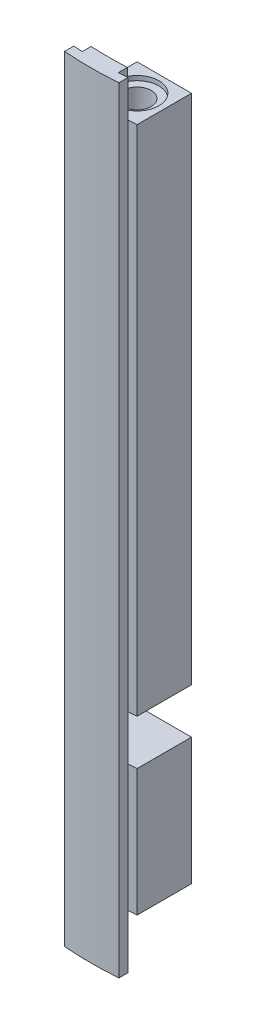
ISO-10303-21;
HEADER;
FILE_DESCRIPTION(('STEP AP214'),'2;1');
FILE_NAME('part.step','',(''),(''),'','','');
FILE_SCHEMA(('AUTOMOTIVE_DESIGN { 1 0 10303 214 1 1 1 1 }'));
ENDSEC;
DATA;
#1=APPLICATION_CONTEXT('core data for automotive mechanical design processes');
#2=APPLICATION_PROTOCOL_DEFINITION('international standard','automotive_design',2000,#1);
#3=PRODUCT_CONTEXT('',#1,'mechanical');
#4=PRODUCT('Part','Part','',(#3));
#5=PRODUCT_RELATED_PRODUCT_CATEGORY('part','',(#4));
#6=PRODUCT_DEFINITION_FORMATION('','',#4);
#7=PRODUCT_DEFINITION_CONTEXT('part definition',#1,'design');
#8=PRODUCT_DEFINITION('design','',#6,#7);
#9=PRODUCT_DEFINITION_SHAPE('','',#8);
#10=(LENGTH_UNIT() NAMED_UNIT(*) SI_UNIT(.MILLI.,.METRE.));
#11=(NAMED_UNIT(*) PLANE_ANGLE_UNIT() SI_UNIT($,.RADIAN.));
#12=(NAMED_UNIT(*) SI_UNIT($,.STERADIAN.) SOLID_ANGLE_UNIT());
#13=UNCERTAINTY_MEASURE_WITH_UNIT(LENGTH_MEASURE(1.E-05),#10,'distance_accuracy_value','');
#14=(GEOMETRIC_REPRESENTATION_CONTEXT(3) GLOBAL_UNCERTAINTY_ASSIGNED_CONTEXT((#13)) GLOBAL_UNIT_ASSIGNED_CONTEXT((#10,
#11,#12)) REPRESENTATION_CONTEXT('',''));
#15=CARTESIAN_POINT('',(0.,0.,0.));
#16=DIRECTION('',(0.,0.,1.));
#17=DIRECTION('',(1.,0.,0.));
#18=AXIS2_PLACEMENT_3D('',#15,#16,#17);
#19=CARTESIAN_POINT('',(-5.27213682165313E-13,-80.5,0.));
#20=DIRECTION('',(0.,1.,0.));
#21=DIRECTION('',(-1.,0.,0.));
#22=AXIS2_PLACEMENT_3D('',#19,#20,#21);
#23=CYLINDRICAL_SURFACE('',#22,37.5);
#24=DIRECTION('',(0.,1.,0.));
#25=VECTOR('',#24,1.);
#26=CARTESIAN_POINT('',(-2.00000115997713,-85.5,37.4466286247519));
#27=LINE('',#26,#25);
#28=CARTESIAN_POINT('',(-2.00000115997714,-80.5,37.446628624752));
#29=VERTEX_POINT('',#28);
#30=CARTESIAN_POINT('',(-2.00000115997713,-66.5,37.4466286247519));
#31=VERTEX_POINT('',#30);
#32=EDGE_CURVE('E314',#29,#31,#27,.T.);
#33=ORIENTED_EDGE('',*,*,#32,.T.);
#34=CARTESIAN_POINT('',(0.,-66.5,0.));
#35=DIRECTION('',(0.,1.,0.));
#36=DIRECTION('',(0.,0.,1.));
#37=AXIS2_PLACEMENT_3D('',#34,#35,#36);
#38=CIRCLE('',#37,37.5);
#39=CARTESIAN_POINT('',(-3.00000000000015,-66.5,37.3798073831313));
#40=VERTEX_POINT('',#39);
#41=EDGE_CURVE('E234',#40,#31,#38,.T.);
#42=ORIENTED_EDGE('',*,*,#41,.F.);
#43=DIRECTION('',(0.,1.,0.));
#44=VECTOR('',#43,1.);
#45=CARTESIAN_POINT('',(-3.00000000000052,-80.5,37.3798073831314));
#46=LINE('',#45,#44);
#47=CARTESIAN_POINT('',(-3.00000000000052,-80.5,37.3798073831314));
#48=VERTEX_POINT('',#47);
#49=EDGE_CURVE('E11',#48,#40,#46,.T.);
#50=ORIENTED_EDGE('',*,*,#49,.F.);
#51=CARTESIAN_POINT('',(-5.27213682165313E-13,-80.5,0.));
#52=DIRECTION('',(0.,-1.,0.));
#53=DIRECTION('',(1.,0.,0.));
#54=AXIS2_PLACEMENT_3D('',#51,#52,#53);
#55=CIRCLE('',#54,37.5);
#56=EDGE_CURVE('E60',#29,#48,#55,.T.);
#57=ORIENTED_EDGE('',*,*,#56,.F.);
#58=EDGE_LOOP('',(#33,#42,#50,#57));
#59=FACE_BOUND('',#58,.T.);
#60=ADVANCED_FACE('F35',(#59),#23,.T.);
#61=DIRECTION('',(0.,1.,0.));
#62=VECTOR('',#61,1.);
#63=CARTESIAN_POINT('',(2.99999999999947,-80.5,37.3798073831314));
#64=LINE('',#63,#62);
#65=CARTESIAN_POINT('',(2.99999999999947,-80.5,37.3798073831314));
#66=VERTEX_POINT('',#65);
#67=CARTESIAN_POINT('',(2.99999999999984,-66.5,37.3798073831313));
#68=VERTEX_POINT('',#67);
#69=EDGE_CURVE('E198',#66,#68,#64,.T.);
#70=ORIENTED_EDGE('',*,*,#69,.T.);
#71=CARTESIAN_POINT('',(2.00000115997713,-66.5,37.4466286247519));
#72=VERTEX_POINT('',#71);
#73=EDGE_CURVE('E181',#72,#68,#38,.T.);
#74=ORIENTED_EDGE('',*,*,#73,.F.);
#75=DIRECTION('',(0.,1.,0.));
#76=VECTOR('',#75,1.);
#77=CARTESIAN_POINT('',(2.00000115997712,-85.5,37.4466286247519));
#78=LINE('',#77,#76);
#79=CARTESIAN_POINT('',(2.00000115997713,-80.5,37.4466286247519));
#80=VERTEX_POINT('',#79);
#81=EDGE_CURVE('E320',#80,#72,#78,.T.);
#82=ORIENTED_EDGE('',*,*,#81,.F.);
#83=EDGE_CURVE('E326',#66,#80,#55,.T.);
#84=ORIENTED_EDGE('',*,*,#83,.F.);
#85=EDGE_LOOP('',(#70,#74,#82,#84));
#86=FACE_BOUND('',#85,.T.);
#87=ADVANCED_FACE('F359',(#86),#23,.T.);
#88=CARTESIAN_POINT('',(-3.00000000000052,-80.5,37.3798073831314));
#89=DIRECTION('',(1.,0.,0.));
#90=DIRECTION('',(0.,1.,0.));
#91=AXIS2_PLACEMENT_3D('',#88,#89,#90);
#92=PLANE('',#91);
#93=ORIENTED_EDGE('',*,*,#49,.T.);
#94=DIRECTION('',(0.,0.,-1.));
#95=VECTOR('',#94,1.);
#96=CARTESIAN_POINT('',(-3.00000000000042,-66.5,37.3798073831314));
#97=LINE('',#96,#95);
#98=CARTESIAN_POINT('',(-3.00000000000053,-66.5,31.3798073831314));
#99=VERTEX_POINT('',#98);
#100=EDGE_CURVE('E248',#40,#99,#97,.T.);
#101=ORIENTED_EDGE('',*,*,#100,.T.);
#102=DIRECTION('',(0.,1.,0.));
#103=VECTOR('',#102,1.);
#104=CARTESIAN_POINT('',(-3.00000000000053,-80.5,31.3798073831314));
#105=LINE('',#104,#103);
#106=CARTESIAN_POINT('',(-3.00000000000053,-80.5,31.3798073831314));
#107=VERTEX_POINT('',#106);
#108=EDGE_CURVE('E212',#107,#99,#105,.T.);
#109=ORIENTED_EDGE('',*,*,#108,.F.);
#110=DIRECTION('',(0.,0.,-1.));
#111=VECTOR('',#110,1.);
#112=CARTESIAN_POINT('',(-3.00000000000052,-80.5,37.3798073831314));
#113=LINE('',#112,#111);
#114=EDGE_CURVE('E329',#48,#107,#113,.T.);
#115=ORIENTED_EDGE('',*,*,#114,.F.);
#116=EDGE_LOOP('',(#93,#101,#109,#115));
#117=FACE_BOUND('',#116,.T.);
#118=ADVANCED_FACE('F347',(#117),#92,.F.);
#119=CARTESIAN_POINT('',(-3.00000000000053,-80.5,31.3798073831314));
#120=DIRECTION('',(0.,0.,1.));
#121=DIRECTION('',(1.,0.,0.));
#122=AXIS2_PLACEMENT_3D('',#119,#120,#121);
#123=PLANE('',#122);
#124=ORIENTED_EDGE('',*,*,#108,.T.);
#125=DIRECTION('',(1.,0.,0.));
#126=VECTOR('',#125,1.);
#127=CARTESIAN_POINT('',(-3.00000000000053,-66.5,31.3798073831314));
#128=LINE('',#127,#126);
#129=CARTESIAN_POINT('',(2.99999999999957,-66.5,31.3798073831314));
#130=VERTEX_POINT('',#129);
#131=EDGE_CURVE('E245',#99,#130,#128,.T.);
#132=ORIENTED_EDGE('',*,*,#131,.T.);
#133=DIRECTION('',(0.,1.,0.));
#134=VECTOR('',#133,1.);
#135=CARTESIAN_POINT('',(2.99999999999947,-80.5,31.3798073831314));
#136=LINE('',#135,#134);
#137=CARTESIAN_POINT('',(2.99999999999947,-80.5,31.3798073831314));
#138=VERTEX_POINT('',#137);
#139=EDGE_CURVE('E208',#138,#130,#136,.T.);
#140=ORIENTED_EDGE('',*,*,#139,.F.);
#141=DIRECTION('',(1.,0.,0.));
#142=VECTOR('',#141,1.);
#143=CARTESIAN_POINT('',(-3.00000000000053,-80.5,31.3798073831314));
#144=LINE('',#143,#142);
#145=EDGE_CURVE('E203',#107,#138,#144,.T.);
#146=ORIENTED_EDGE('',*,*,#145,.F.);
#147=EDGE_LOOP('',(#124,#132,#140,#146));
#148=FACE_BOUND('',#147,.T.);
#149=ADVANCED_FACE('F436',(#148),#123,.F.);
#150=CARTESIAN_POINT('',(2.99999999999947,-80.5,31.3798073831314));
#151=DIRECTION('',(-1.,0.,0.));
#152=DIRECTION('',(0.,-1.,0.));
#153=AXIS2_PLACEMENT_3D('',#150,#151,#152);
#154=PLANE('',#153);
#155=ORIENTED_EDGE('',*,*,#139,.T.);
#156=DIRECTION('',(0.,0.,1.));
#157=VECTOR('',#156,1.);
#158=CARTESIAN_POINT('',(2.99999999999957,-66.5,31.3798073831314));
#159=LINE('',#158,#157);
#160=EDGE_CURVE('E242',#130,#68,#159,.T.);
#161=ORIENTED_EDGE('',*,*,#160,.T.);
#162=ORIENTED_EDGE('',*,*,#69,.F.);
#163=DIRECTION('',(0.,0.,1.));
#164=VECTOR('',#163,1.);
#165=CARTESIAN_POINT('',(2.99999999999947,-80.5,31.3798073831314));
#166=LINE('',#165,#164);
#167=EDGE_CURVE('E199',#138,#66,#166,.T.);
#168=ORIENTED_EDGE('',*,*,#167,.F.);
#169=EDGE_LOOP('',(#155,#161,#162,#168));
#170=FACE_BOUND('',#169,.T.);
#171=ADVANCED_FACE('F431',(#170),#154,.F.);
#172=CARTESIAN_POINT('',(-3.00000000000039,-61.5,37.3798073831313));
#173=VERTEX_POINT('',#172);
#174=CARTESIAN_POINT('',(-2.99999999999999,-4.99999999999998,37.3798073831314));
#175=VERTEX_POINT('',#174);
#176=EDGE_CURVE('E44',#173,#175,#46,.T.);
#177=ORIENTED_EDGE('',*,*,#176,.F.);
#178=CARTESIAN_POINT('',(0.,-61.5,0.));
#179=DIRECTION('',(0.,1.,0.));
#180=DIRECTION('',(0.,0.,1.));
#181=AXIS2_PLACEMENT_3D('',#178,#179,#180);
#182=CIRCLE('',#181,37.5);
#183=CARTESIAN_POINT('',(-2.00000115997713,-61.5,37.4466286247519));
#184=VERTEX_POINT('',#183);
#185=EDGE_CURVE('E191',#173,#184,#182,.T.);
#186=ORIENTED_EDGE('',*,*,#185,.T.);
#187=CARTESIAN_POINT('',(-2.00000115997713,-5.00000000000027,37.4466286247519));
#188=VERTEX_POINT('',#187);
#189=EDGE_CURVE('E315',#184,#188,#27,.T.);
#190=ORIENTED_EDGE('',*,*,#189,.T.);
#191=CARTESIAN_POINT('',(0.,-5.,0.));
#192=DIRECTION('',(0.,-1.,0.));
#193=DIRECTION('',(1.,0.,0.));
#194=AXIS2_PLACEMENT_3D('',#191,#192,#193);
#195=CIRCLE('',#194,37.5);
#196=EDGE_CURVE('E325',#188,#175,#195,.T.);
#197=ORIENTED_EDGE('',*,*,#196,.T.);
#198=EDGE_LOOP('',(#177,#186,#190,#197));
#199=FACE_BOUND('',#198,.T.);
#200=ADVANCED_FACE('F422',(#199),#23,.T.);
#201=CARTESIAN_POINT('',(2.00000115997712,-61.5,37.4466286247519));
#202=VERTEX_POINT('',#201);
#203=CARTESIAN_POINT('',(2.00000115997713,-5.00000000000001,37.4466286247519));
#204=VERTEX_POINT('',#203);
#205=EDGE_CURVE('E188',#202,#204,#78,.T.);
#206=ORIENTED_EDGE('',*,*,#205,.F.);
#207=CARTESIAN_POINT('',(2.9999999999996,-61.5,37.3798073831314));
#208=VERTEX_POINT('',#207);
#209=EDGE_CURVE('E52',#202,#208,#182,.T.);
#210=ORIENTED_EDGE('',*,*,#209,.T.);
#211=CARTESIAN_POINT('',(2.99999999999999,-5.00000000000002,37.3798073831314));
#212=VERTEX_POINT('',#211);
#213=EDGE_CURVE('E186',#208,#212,#64,.T.);
#214=ORIENTED_EDGE('',*,*,#213,.T.);
#215=EDGE_CURVE('E332',#212,#204,#195,.T.);
#216=ORIENTED_EDGE('',*,*,#215,.T.);
#217=EDGE_LOOP('',(#206,#210,#214,#216));
#218=FACE_BOUND('',#217,.T.);
#219=ADVANCED_FACE('F37',(#218),#23,.T.);
#220=CARTESIAN_POINT('',(-3.00000000000053,-61.5,31.3798073831314));
#221=VERTEX_POINT('',#220);
#222=CARTESIAN_POINT('',(-3.,-4.99999999999998,31.3798073831314));
#223=VERTEX_POINT('',#222);
#224=EDGE_CURVE('E211',#221,#223,#105,.T.);
#225=ORIENTED_EDGE('',*,*,#224,.F.);
#226=DIRECTION('',(0.,0.,1.));
#227=VECTOR('',#226,1.);
#228=CARTESIAN_POINT('',(-3.00000000000039,-61.5,37.3798073831314));
#229=LINE('',#228,#227);
#230=EDGE_CURVE('E237',#221,#173,#229,.T.);
#231=ORIENTED_EDGE('',*,*,#230,.T.);
#232=ORIENTED_EDGE('',*,*,#176,.T.);
#233=DIRECTION('',(0.,0.,-1.));
#234=VECTOR('',#233,1.);
#235=CARTESIAN_POINT('',(-2.99999999999999,-4.99999999999998,37.3798073831314));
#236=LINE('',#235,#234);
#237=EDGE_CURVE('E334',#175,#223,#236,.T.);
#238=ORIENTED_EDGE('',*,*,#237,.T.);
#239=EDGE_LOOP('',(#225,#231,#232,#238));
#240=FACE_BOUND('',#239,.T.);
#241=ADVANCED_FACE('F424',(#240),#92,.F.);
#242=CARTESIAN_POINT('',(2.9999999999996,-61.5,31.3798073831314));
#243=VERTEX_POINT('',#242);
#244=CARTESIAN_POINT('',(3.,-5.00000000000002,31.3798073831314));
#245=VERTEX_POINT('',#244);
#246=EDGE_CURVE('E202',#243,#245,#136,.T.);
#247=ORIENTED_EDGE('',*,*,#246,.F.);
#248=DIRECTION('',(-1.,0.,0.));
#249=VECTOR('',#248,1.);
#250=CARTESIAN_POINT('',(-3.00000000000053,-61.5,31.3798073831314));
#251=LINE('',#250,#249);
#252=EDGE_CURVE('E177',#243,#221,#251,.T.);
#253=ORIENTED_EDGE('',*,*,#252,.T.);
#254=ORIENTED_EDGE('',*,*,#224,.T.);
#255=DIRECTION('',(1.,0.,0.));
#256=VECTOR('',#255,1.);
#257=CARTESIAN_POINT('',(-3.,-4.99999999999998,31.3798073831314));
#258=LINE('',#257,#256);
#259=EDGE_CURVE('E337',#223,#245,#258,.T.);
#260=ORIENTED_EDGE('',*,*,#259,.T.);
#261=EDGE_LOOP('',(#247,#253,#254,#260));
#262=FACE_BOUND('',#261,.T.);
#263=ADVANCED_FACE('F429',(#262),#123,.F.);
#264=ORIENTED_EDGE('',*,*,#213,.F.);
#265=DIRECTION('',(0.,0.,-1.));
#266=VECTOR('',#265,1.);
#267=CARTESIAN_POINT('',(2.9999999999996,-61.5,31.3798073831314));
#268=LINE('',#267,#266);
#269=EDGE_CURVE('E174',#208,#243,#268,.T.);
#270=ORIENTED_EDGE('',*,*,#269,.T.);
#271=ORIENTED_EDGE('',*,*,#246,.T.);
#272=DIRECTION('',(0.,0.,1.));
#273=VECTOR('',#272,1.);
#274=CARTESIAN_POINT('',(3.,-5.00000000000002,31.3798073831314));
#275=LINE('',#274,#273);
#276=EDGE_CURVE('E196',#245,#212,#275,.T.);
#277=ORIENTED_EDGE('',*,*,#276,.T.);
#278=EDGE_LOOP('',(#264,#270,#271,#277));
#279=FACE_BOUND('',#278,.T.);
#280=ADVANCED_FACE('F194',(#279),#154,.F.);
#281=CARTESIAN_POINT('',(-5.27213682165313E-13,-80.5,0.));
#282=DIRECTION('',(0.,-1.,0.));
#283=DIRECTION('',(1.,0.,0.));
#284=AXIS2_PLACEMENT_3D('',#281,#282,#283);
#285=PLANE('',#284);
#286=CARTESIAN_POINT('',(-5.62128495553744E-13,-80.5,34.420864200588));
#287=DIRECTION('',(0.,-1.,0.));
#288=DIRECTION('',(0.,0.,-1.));
#289=AXIS2_PLACEMENT_3D('',#286,#287,#288);
#290=CIRCLE('',#289,2.4);
#291=CARTESIAN_POINT('',(-5.62128495553744E-13,-80.5,32.020864200588));
#292=VERTEX_POINT('',#291);
#293=EDGE_CURVE('E223',#292,#292,#290,.T.);
#294=ORIENTED_EDGE('',*,*,#293,.F.);
#295=EDGE_LOOP('',(#294));
#296=FACE_BOUND('',#295,.T.);
#297=ORIENTED_EDGE('',*,*,#83,.T.);
#298=CARTESIAN_POINT('',(0.,-80.5,0.));
#299=DIRECTION('',(0.,-1.,0.));
#300=DIRECTION('',(1.,0.,0.));
#301=AXIS2_PLACEMENT_3D('',#298,#299,#300);
#302=CIRCLE('',#301,37.5);
#303=EDGE_CURVE('E302',#29,#80,#302,.F.);
#304=ORIENTED_EDGE('',*,*,#303,.F.);
#305=ORIENTED_EDGE('',*,*,#56,.T.);
#306=ORIENTED_EDGE('',*,*,#114,.T.);
#307=ORIENTED_EDGE('',*,*,#145,.T.);
#308=ORIENTED_EDGE('',*,*,#167,.T.);
#309=EDGE_LOOP('',(#297,#304,#305,#306,#307,#308));
#310=FACE_BOUND('',#309,.T.);
#311=ADVANCED_FACE('F343',(#296,#310),#285,.T.);
#312=CARTESIAN_POINT('',(0.,-5.,0.));
#313=DIRECTION('',(0.,-1.,0.));
#314=DIRECTION('',(1.,0.,0.));
#315=AXIS2_PLACEMENT_3D('',#312,#313,#314);
#316=PLANE('',#315);
#317=CARTESIAN_POINT('',(0.,-5.,34.3798073831313));
#318=DIRECTION('',(0.,-1.,0.));
#319=DIRECTION('',(1.,0.,0.));
#320=AXIS2_PLACEMENT_3D('',#317,#318,#319);
#321=CIRCLE('',#320,2.4);
#322=CARTESIAN_POINT('',(2.4,-5.00000000000002,34.3798073831313));
#323=VERTEX_POINT('',#322);
#324=EDGE_CURVE('E231',#323,#323,#321,.T.);
#325=ORIENTED_EDGE('',*,*,#324,.T.);
#326=EDGE_LOOP('',(#325));
#327=FACE_BOUND('',#326,.T.);
#328=ORIENTED_EDGE('',*,*,#215,.F.);
#329=ORIENTED_EDGE('',*,*,#276,.F.);
#330=ORIENTED_EDGE('',*,*,#259,.F.);
#331=ORIENTED_EDGE('',*,*,#237,.F.);
#332=ORIENTED_EDGE('',*,*,#196,.F.);
#333=EDGE_CURVE('E335',#204,#188,#195,.T.);
#334=ORIENTED_EDGE('',*,*,#333,.F.);
#335=EDGE_LOOP('',(#328,#329,#330,#331,#332,#334));
#336=FACE_BOUND('',#335,.T.);
#337=ADVANCED_FACE('F372',(#327,#336),#316,.F.);
#338=CARTESIAN_POINT('',(0.,-85.5,0.));
#339=DIRECTION('',(0.,1.,0.));
#340=DIRECTION('',(0.,0.,1.));
#341=AXIS2_PLACEMENT_3D('',#338,#339,#340);
#342=CYLINDRICAL_SURFACE('',#341,37.5);
#343=ORIENTED_EDGE('',*,*,#333,.T.);
#344=CARTESIAN_POINT('',(-2.00000115997713,0.,37.4466286247519));
#345=VERTEX_POINT('',#344);
#346=EDGE_CURVE('E319',#188,#345,#27,.T.);
#347=ORIENTED_EDGE('',*,*,#346,.T.);
#348=CARTESIAN_POINT('',(0.,0.,0.));
#349=DIRECTION('',(0.,-1.,0.));
#350=DIRECTION('',(0.,0.,1.));
#351=AXIS2_PLACEMENT_3D('',#348,#349,#350);
#352=CIRCLE('',#351,37.5);
#353=CARTESIAN_POINT('',(2.00000115997712,0.,37.4466286247519));
#354=VERTEX_POINT('',#353);
#355=EDGE_CURVE('E283',#354,#345,#352,.T.);
#356=ORIENTED_EDGE('',*,*,#355,.F.);
#357=EDGE_CURVE('E322',#204,#354,#78,.T.);
#358=ORIENTED_EDGE('',*,*,#357,.F.);
#359=EDGE_LOOP('',(#343,#347,#356,#358));
#360=FACE_BOUND('',#359,.T.);
#361=ADVANCED_FACE('F377',(#360),#342,.F.);
#362=CARTESIAN_POINT('',(0.,-85.5,0.));
#363=DIRECTION('',(0.,1.,0.));
#364=DIRECTION('',(0.,0.,1.));
#365=AXIS2_PLACEMENT_3D('',#362,#363,#364);
#366=CYLINDRICAL_SURFACE('',#365,38.4981020865803);
#367=CARTESIAN_POINT('',(0.,0.,0.));
#368=DIRECTION('',(0.,-1.,0.));
#369=DIRECTION('',(0.,0.,-1.));
#370=AXIS2_PLACEMENT_3D('',#367,#368,#369);
#371=CIRCLE('',#370,38.4981020865803);
#372=CARTESIAN_POINT('',(3.00000115997713,0.,38.3810351255525));
#373=VERTEX_POINT('',#372);
#374=CARTESIAN_POINT('',(2.00000115997713,0.,38.44611631399));
#375=VERTEX_POINT('',#374);
#376=EDGE_CURVE('E251',#373,#375,#371,.T.);
#377=ORIENTED_EDGE('',*,*,#376,.F.);
#378=DIRECTION('',(0.,1.,0.));
#379=VECTOR('',#378,1.);
#380=CARTESIAN_POINT('',(3.00000115997713,-85.5,38.3810351255525));
#381=LINE('',#380,#379);
#382=CARTESIAN_POINT('',(3.00000115997713,-85.5,38.3810351255525));
#383=VERTEX_POINT('',#382);
#384=EDGE_CURVE('E300',#383,#373,#381,.T.);
#385=ORIENTED_EDGE('',*,*,#384,.F.);
#386=CARTESIAN_POINT('',(0.,-85.5,0.));
#387=DIRECTION('',(0.,-1.,0.));
#388=DIRECTION('',(0.,0.,-1.));
#389=AXIS2_PLACEMENT_3D('',#386,#387,#388);
#390=CIRCLE('',#389,38.4981020865803);
#391=CARTESIAN_POINT('',(2.00000115997713,-85.5,38.44611631399));
#392=VERTEX_POINT('',#391);
#393=EDGE_CURVE('E252',#383,#392,#390,.T.);
#394=ORIENTED_EDGE('',*,*,#393,.T.);
#395=DIRECTION('',(0.,1.,0.));
#396=VECTOR('',#395,1.);
#397=CARTESIAN_POINT('',(2.00000115997713,-85.5,38.44611631399));
#398=LINE('',#397,#396);
#399=EDGE_CURVE('E277',#392,#375,#398,.T.);
#400=ORIENTED_EDGE('',*,*,#399,.T.);
#401=EDGE_LOOP('',(#377,#385,#394,#400));
#402=FACE_BOUND('',#401,.T.);
#403=ADVANCED_FACE('F390',(#402),#366,.F.);
#404=CARTESIAN_POINT('',(3.00000115997713,-85.5,38.3810351255525));
#405=DIRECTION('',(1.,0.,0.));
#406=DIRECTION('',(0.,0.,-1.));
#407=AXIS2_PLACEMENT_3D('',#404,#405,#406);
#408=PLANE('',#407);
#409=DIRECTION('',(0.,0.,-1.));
#410=VECTOR('',#409,1.);
#411=CARTESIAN_POINT('',(3.00000115997713,0.,38.3810351255525));
#412=LINE('',#411,#410);
#413=CARTESIAN_POINT('',(3.00000115997713,0.,39.3859110982612));
#414=VERTEX_POINT('',#413);
#415=EDGE_CURVE('E256',#414,#373,#412,.T.);
#416=ORIENTED_EDGE('',*,*,#415,.F.);
#417=DIRECTION('',(0.,1.,0.));
#418=VECTOR('',#417,1.);
#419=CARTESIAN_POINT('',(3.00000115997713,-85.5,39.3859110982612));
#420=LINE('',#419,#418);
#421=CARTESIAN_POINT('',(3.00000115997713,-85.5,39.3859110982612));
#422=VERTEX_POINT('',#421);
#423=EDGE_CURVE('E303',#422,#414,#420,.T.);
#424=ORIENTED_EDGE('',*,*,#423,.F.);
#425=DIRECTION('',(0.,0.,-1.));
#426=VECTOR('',#425,1.);
#427=CARTESIAN_POINT('',(3.00000115997713,-85.5,38.3810351255525));
#428=LINE('',#427,#426);
#429=EDGE_CURVE('E274',#422,#383,#428,.T.);
#430=ORIENTED_EDGE('',*,*,#429,.T.);
#431=ORIENTED_EDGE('',*,*,#384,.T.);
#432=EDGE_LOOP('',(#416,#424,#430,#431));
#433=FACE_BOUND('',#432,.T.);
#434=ADVANCED_FACE('F393',(#433),#408,.T.);
#435=CARTESIAN_POINT('',(0.,-85.5,0.));
#436=DIRECTION('',(0.,1.,0.));
#437=DIRECTION('',(0.,0.,1.));
#438=AXIS2_PLACEMENT_3D('',#435,#436,#437);
#439=CYLINDRICAL_SURFACE('',#438,39.5);
#440=CARTESIAN_POINT('',(0.,0.,0.));
#441=DIRECTION('',(0.,1.,0.));
#442=DIRECTION('',(0.,0.,1.));
#443=AXIS2_PLACEMENT_3D('',#440,#441,#442);
#444=CIRCLE('',#443,39.5);
#445=CARTESIAN_POINT('',(-2.99999884002287,0.,39.3859112749707));
#446=VERTEX_POINT('',#445);
#447=EDGE_CURVE('E295',#446,#414,#444,.T.);
#448=ORIENTED_EDGE('',*,*,#447,.F.);
#449=DIRECTION('',(0.,1.,0.));
#450=VECTOR('',#449,1.);
#451=CARTESIAN_POINT('',(-2.99999884002287,-85.5,39.3859112749707));
#452=LINE('',#451,#450);
#453=CARTESIAN_POINT('',(-2.99999884002287,-85.5,39.3859112749707));
#454=VERTEX_POINT('',#453);
#455=EDGE_CURVE('E305',#454,#446,#452,.T.);
#456=ORIENTED_EDGE('',*,*,#455,.F.);
#457=CARTESIAN_POINT('',(0.,-85.5,0.));
#458=DIRECTION('',(0.,1.,0.));
#459=DIRECTION('',(0.,0.,1.));
#460=AXIS2_PLACEMENT_3D('',#457,#458,#459);
#461=CIRCLE('',#460,39.5);
#462=EDGE_CURVE('E271',#454,#422,#461,.T.);
#463=ORIENTED_EDGE('',*,*,#462,.T.);
#464=ORIENTED_EDGE('',*,*,#423,.T.);
#465=EDGE_LOOP('',(#448,#456,#463,#464));
#466=FACE_BOUND('',#465,.T.);
#467=ADVANCED_FACE('F507',(#466),#439,.T.);
#468=CARTESIAN_POINT('',(-2.99999884002287,-85.5,38.3601653188769));
#469=DIRECTION('',(-1.,0.,0.));
#470=DIRECTION('',(0.,0.,1.));
#471=AXIS2_PLACEMENT_3D('',#468,#469,#470);
#472=PLANE('',#471);
#473=DIRECTION('',(0.,0.,1.));
#474=VECTOR('',#473,1.);
#475=CARTESIAN_POINT('',(-2.99999884002287,0.,38.3601653188769));
#476=LINE('',#475,#474);
#477=CARTESIAN_POINT('',(-2.99999884002287,0.,38.3601653188769));
#478=VERTEX_POINT('',#477);
#479=EDGE_CURVE('E292',#478,#446,#476,.T.);
#480=ORIENTED_EDGE('',*,*,#479,.F.);
#481=DIRECTION('',(0.,1.,0.));
#482=VECTOR('',#481,1.);
#483=CARTESIAN_POINT('',(-2.99999884002287,-85.5,38.3601653188769));
#484=LINE('',#483,#482);
#485=CARTESIAN_POINT('',(-2.99999884002287,-85.5,38.3601653188769));
#486=VERTEX_POINT('',#485);
#487=EDGE_CURVE('E307',#486,#478,#484,.T.);
#488=ORIENTED_EDGE('',*,*,#487,.F.);
#489=DIRECTION('',(0.,0.,1.));
#490=VECTOR('',#489,1.);
#491=CARTESIAN_POINT('',(-2.99999884002287,-85.5,38.3601653188769));
#492=LINE('',#491,#490);
#493=EDGE_CURVE('E268',#486,#454,#492,.T.);
#494=ORIENTED_EDGE('',*,*,#493,.T.);
#495=ORIENTED_EDGE('',*,*,#455,.T.);
#496=EDGE_LOOP('',(#480,#488,#494,#495));
#497=FACE_BOUND('',#496,.T.);
#498=ADVANCED_FACE('F400',(#497),#472,.T.);
#499=CARTESIAN_POINT('',(0.,-85.5,0.));
#500=DIRECTION('',(0.,1.,0.));
#501=DIRECTION('',(0.,0.,1.));
#502=AXIS2_PLACEMENT_3D('',#499,#500,#501);
#503=CYLINDRICAL_SURFACE('',#502,38.4772955953469);
#504=CARTESIAN_POINT('',(0.,0.,0.));
#505=DIRECTION('',(0.,-1.,0.));
#506=DIRECTION('',(0.,0.,1.));
#507=AXIS2_PLACEMENT_3D('',#504,#505,#506);
#508=CIRCLE('',#507,38.4772955953469);
#509=CARTESIAN_POINT('',(-2.00000115997713,0.,38.4252816735518));
#510=VERTEX_POINT('',#509);
#511=EDGE_CURVE('E289',#510,#478,#508,.T.);
#512=ORIENTED_EDGE('',*,*,#511,.F.);
#513=DIRECTION('',(0.,1.,0.));
#514=VECTOR('',#513,1.);
#515=CARTESIAN_POINT('',(-2.00000115997713,-85.5,38.4252816735518));
#516=LINE('',#515,#514);
#517=CARTESIAN_POINT('',(-2.00000115997713,-85.5,38.4252816735518));
#518=VERTEX_POINT('',#517);
#519=EDGE_CURVE('E309',#518,#510,#516,.T.);
#520=ORIENTED_EDGE('',*,*,#519,.F.);
#521=CARTESIAN_POINT('',(0.,-85.5,0.));
#522=DIRECTION('',(0.,-1.,0.));
#523=DIRECTION('',(0.,0.,1.));
#524=AXIS2_PLACEMENT_3D('',#521,#522,#523);
#525=CIRCLE('',#524,38.4772955953469);
#526=EDGE_CURVE('E265',#518,#486,#525,.T.);
#527=ORIENTED_EDGE('',*,*,#526,.T.);
#528=ORIENTED_EDGE('',*,*,#487,.T.);
#529=EDGE_LOOP('',(#512,#520,#527,#528));
#530=FACE_BOUND('',#529,.T.);
#531=ADVANCED_FACE('F404',(#530),#503,.F.);
#532=CARTESIAN_POINT('',(-2.00000115997713,-85.5,38.4252816735518));
#533=DIRECTION('',(-1.,0.,0.));
#534=DIRECTION('',(0.,0.,1.));
#535=AXIS2_PLACEMENT_3D('',#532,#533,#534);
#536=PLANE('',#535);
#537=DIRECTION('',(0.,0.,1.));
#538=VECTOR('',#537,1.);
#539=CARTESIAN_POINT('',(-2.00000115997713,0.,38.4252816735518));
#540=LINE('',#539,#538);
#541=EDGE_CURVE('E286',#345,#510,#540,.T.);
#542=ORIENTED_EDGE('',*,*,#541,.F.);
#543=ORIENTED_EDGE('',*,*,#346,.F.);
#544=ORIENTED_EDGE('',*,*,#189,.F.);
#545=DIRECTION('',(0.,1.,0.));
#546=VECTOR('',#545,1.);
#547=CARTESIAN_POINT('',(-2.00000115997713,-27.0166893777323,37.4466286247519));
#548=LINE('',#547,#546);
#549=EDGE_CURVE('E240',#31,#184,#548,.T.);
#550=ORIENTED_EDGE('',*,*,#549,.F.);
#551=ORIENTED_EDGE('',*,*,#32,.F.);
#552=CARTESIAN_POINT('',(-2.00000115997713,-85.5,37.4466286247519));
#553=VERTEX_POINT('',#552);
#554=EDGE_CURVE('E311',#553,#29,#27,.T.);
#555=ORIENTED_EDGE('',*,*,#554,.F.);
#556=DIRECTION('',(0.,0.,1.));
#557=VECTOR('',#556,1.);
#558=CARTESIAN_POINT('',(-2.00000115997713,-85.5,38.4252816735518));
#559=LINE('',#558,#557);
#560=EDGE_CURVE('E262',#553,#518,#559,.T.);
#561=ORIENTED_EDGE('',*,*,#560,.T.);
#562=ORIENTED_EDGE('',*,*,#519,.T.);
#563=EDGE_LOOP('',(#542,#543,#544,#550,#551,#555,#561,#562));
#564=FACE_BOUND('',#563,.T.);
#565=ADVANCED_FACE('F406',(#564),#536,.T.);
#566=ORIENTED_EDGE('',*,*,#554,.T.);
#567=ORIENTED_EDGE('',*,*,#303,.T.);
#568=CARTESIAN_POINT('',(2.00000115997712,-85.5,37.4466286247519));
#569=VERTEX_POINT('',#568);
#570=EDGE_CURVE('E316',#569,#80,#78,.T.);
#571=ORIENTED_EDGE('',*,*,#570,.F.);
#572=CARTESIAN_POINT('',(0.,-85.5,0.));
#573=DIRECTION('',(0.,-1.,0.));
#574=DIRECTION('',(0.,0.,1.));
#575=AXIS2_PLACEMENT_3D('',#572,#573,#574);
#576=CIRCLE('',#575,37.5);
#577=EDGE_CURVE('E259',#569,#553,#576,.T.);
#578=ORIENTED_EDGE('',*,*,#577,.T.);
#579=EDGE_LOOP('',(#566,#567,#571,#578));
#580=FACE_BOUND('',#579,.T.);
#581=ADVANCED_FACE('F408',(#580),#342,.F.);
#582=CARTESIAN_POINT('',(2.00000115997713,-85.5,38.44611631399));
#583=DIRECTION('',(1.,0.,0.));
#584=DIRECTION('',(0.,0.,-1.));
#585=AXIS2_PLACEMENT_3D('',#582,#583,#584);
#586=PLANE('',#585);
#587=DIRECTION('',(0.,0.,-1.));
#588=VECTOR('',#587,1.);
#589=CARTESIAN_POINT('',(2.00000115997713,0.,38.44611631399));
#590=LINE('',#589,#588);
#591=EDGE_CURVE('E280',#375,#354,#590,.T.);
#592=ORIENTED_EDGE('',*,*,#591,.F.);
#593=ORIENTED_EDGE('',*,*,#399,.F.);
#594=DIRECTION('',(0.,0.,-1.));
#595=VECTOR('',#594,1.);
#596=CARTESIAN_POINT('',(2.00000115997713,-85.5,38.44611631399));
#597=LINE('',#596,#595);
#598=EDGE_CURVE('E255',#392,#569,#597,.T.);
#599=ORIENTED_EDGE('',*,*,#598,.T.);
#600=ORIENTED_EDGE('',*,*,#570,.T.);
#601=ORIENTED_EDGE('',*,*,#81,.T.);
#602=EDGE_CURVE('E365',#72,#202,#78,.T.);
#603=ORIENTED_EDGE('',*,*,#602,.T.);
#604=ORIENTED_EDGE('',*,*,#205,.T.);
#605=ORIENTED_EDGE('',*,*,#357,.T.);
#606=EDGE_LOOP('',(#592,#593,#599,#600,#601,#603,#604,#605));
#607=FACE_BOUND('',#606,.T.);
#608=ADVANCED_FACE('F364',(#607),#586,.T.);
#609=CARTESIAN_POINT('',(0.,-85.5,0.));
#610=DIRECTION('',(0.,-1.,0.));
#611=DIRECTION('',(0.,0.,-1.));
#612=AXIS2_PLACEMENT_3D('',#609,#610,#611);
#613=PLANE('',#612);
#614=ORIENTED_EDGE('',*,*,#393,.F.);
#615=ORIENTED_EDGE('',*,*,#429,.F.);
#616=ORIENTED_EDGE('',*,*,#462,.F.);
#617=ORIENTED_EDGE('',*,*,#493,.F.);
#618=ORIENTED_EDGE('',*,*,#526,.F.);
#619=ORIENTED_EDGE('',*,*,#560,.F.);
#620=ORIENTED_EDGE('',*,*,#577,.F.);
#621=ORIENTED_EDGE('',*,*,#598,.F.);
#622=EDGE_LOOP('',(#614,#615,#616,#617,#618,#619,#620,#621));
#623=FACE_BOUND('',#622,.T.);
#624=ADVANCED_FACE('F387',(#623),#613,.T.);
#625=CARTESIAN_POINT('',(0.,0.,0.));
#626=DIRECTION('',(0.,-1.,0.));
#627=DIRECTION('',(0.,0.,-1.));
#628=AXIS2_PLACEMENT_3D('',#625,#626,#627);
#629=PLANE('',#628);
#630=ORIENTED_EDGE('',*,*,#376,.T.);
#631=ORIENTED_EDGE('',*,*,#591,.T.);
#632=ORIENTED_EDGE('',*,*,#355,.T.);
#633=ORIENTED_EDGE('',*,*,#541,.T.);
#634=ORIENTED_EDGE('',*,*,#511,.T.);
#635=ORIENTED_EDGE('',*,*,#479,.T.);
#636=ORIENTED_EDGE('',*,*,#447,.T.);
#637=ORIENTED_EDGE('',*,*,#415,.T.);
#638=EDGE_LOOP('',(#630,#631,#632,#633,#634,#635,#636,#637));
#639=FACE_BOUND('',#638,.T.);
#640=ADVANCED_FACE('F380',(#639),#629,.F.);
#641=CARTESIAN_POINT('',(0.,-66.5,0.));
#642=DIRECTION('',(0.,-1.,0.));
#643=DIRECTION('',(0.,0.,-1.));
#644=AXIS2_PLACEMENT_3D('',#641,#642,#643);
#645=PLANE('',#644);
#646=ORIENTED_EDGE('',*,*,#41,.T.);
#647=EDGE_CURVE('E190',#31,#72,#38,.T.);
#648=ORIENTED_EDGE('',*,*,#647,.T.);
#649=ORIENTED_EDGE('',*,*,#73,.T.);
#650=ORIENTED_EDGE('',*,*,#160,.F.);
#651=ORIENTED_EDGE('',*,*,#131,.F.);
#652=ORIENTED_EDGE('',*,*,#100,.F.);
#653=EDGE_LOOP('',(#646,#648,#649,#650,#651,#652));
#654=FACE_BOUND('',#653,.T.);
#655=ADVANCED_FACE('F355',(#654),#645,.F.);
#656=CARTESIAN_POINT('',(0.,-61.5,0.));
#657=DIRECTION('',(0.,1.,0.));
#658=DIRECTION('',(0.,0.,1.));
#659=AXIS2_PLACEMENT_3D('',#656,#657,#658);
#660=PLANE('',#659);
#661=ORIENTED_EDGE('',*,*,#252,.F.);
#662=ORIENTED_EDGE('',*,*,#269,.F.);
#663=ORIENTED_EDGE('',*,*,#209,.F.);
#664=EDGE_CURVE('E193',#184,#202,#182,.T.);
#665=ORIENTED_EDGE('',*,*,#664,.F.);
#666=ORIENTED_EDGE('',*,*,#185,.F.);
#667=ORIENTED_EDGE('',*,*,#230,.F.);
#668=EDGE_LOOP('',(#661,#662,#663,#665,#666,#667));
#669=FACE_BOUND('',#668,.T.);
#670=ADVANCED_FACE('F175',(#669),#660,.F.);
#671=CARTESIAN_POINT('',(0.,-27.0166893777323,0.));
#672=DIRECTION('',(0.,1.,0.));
#673=DIRECTION('',(0.,0.,1.));
#674=AXIS2_PLACEMENT_3D('',#671,#672,#673);
#675=CYLINDRICAL_SURFACE('',#674,37.5);
#676=ORIENTED_EDGE('',*,*,#549,.T.);
#677=ORIENTED_EDGE('',*,*,#664,.T.);
#678=ORIENTED_EDGE('',*,*,#602,.F.);
#679=ORIENTED_EDGE('',*,*,#647,.F.);
#680=EDGE_LOOP('',(#676,#677,#678,#679));
#681=FACE_BOUND('',#680,.T.);
#682=ADVANCED_FACE('F590',(#681),#675,.F.);
#683=CARTESIAN_POINT('',(-5.62128495553744E-13,-80.,34.420864200588));
#684=DIRECTION('',(0.,-1.,0.));
#685=DIRECTION('',(0.,0.,-1.));
#686=AXIS2_PLACEMENT_3D('',#683,#684,#685);
#687=PLANE('',#686);
#688=CARTESIAN_POINT('',(-5.62128495553744E-13,-80.,34.420864200588));
#689=DIRECTION('',(0.,-1.,0.));
#690=DIRECTION('',(0.,0.,-1.));
#691=AXIS2_PLACEMENT_3D('',#688,#689,#690);
#692=CIRCLE('',#691,2.4);
#693=CARTESIAN_POINT('',(-5.62128495553744E-13,-80.,32.020864200588));
#694=VERTEX_POINT('',#693);
#695=EDGE_CURVE('E217',#694,#694,#692,.T.);
#696=ORIENTED_EDGE('',*,*,#695,.T.);
#697=EDGE_LOOP('',(#696));
#698=FACE_BOUND('',#697,.T.);
#699=CARTESIAN_POINT('',(-5.62128495553744E-13,-80.,34.420864200588));
#700=DIRECTION('',(0.,-1.,0.));
#701=DIRECTION('',(0.,0.,-1.));
#702=AXIS2_PLACEMENT_3D('',#699,#700,#701);
#703=CIRCLE('',#702,1.55);
#704=CARTESIAN_POINT('',(-5.62128495553744E-13,-80.,32.870864200588));
#705=VERTEX_POINT('',#704);
#706=EDGE_CURVE('E214',#705,#705,#703,.F.);
#707=ORIENTED_EDGE('',*,*,#706,.T.);
#708=EDGE_LOOP('',(#707));
#709=FACE_BOUND('',#708,.T.);
#710=ADVANCED_FACE('F598',(#698,#709),#687,.T.);
#711=CARTESIAN_POINT('',(-5.62128495553744E-13,-80.,34.420864200588));
#712=DIRECTION('',(0.,-1.,0.));
#713=DIRECTION('',(0.,0.,-1.));
#714=AXIS2_PLACEMENT_3D('',#711,#712,#713);
#715=CYLINDRICAL_SURFACE('',#714,2.4);
#716=ORIENTED_EDGE('',*,*,#695,.F.);
#717=EDGE_LOOP('',(#716));
#718=FACE_BOUND('',#717,.T.);
#719=ORIENTED_EDGE('',*,*,#293,.T.);
#720=EDGE_LOOP('',(#719));
#721=FACE_BOUND('',#720,.T.);
#722=ADVANCED_FACE('F609',(#718,#721),#715,.F.);
#723=CARTESIAN_POINT('',(-5.62128495553744E-13,-76.2,34.420864200588));
#724=DIRECTION('',(0.,-1.,0.));
#725=DIRECTION('',(0.,0.,-1.));
#726=AXIS2_PLACEMENT_3D('',#723,#724,#725);
#727=PLANE('',#726);
#728=CARTESIAN_POINT('',(-5.62128495553744E-13,-76.2,34.420864200588));
#729=DIRECTION('',(0.,-1.,0.));
#730=DIRECTION('',(0.,0.,-1.));
#731=AXIS2_PLACEMENT_3D('',#728,#729,#730);
#732=CIRCLE('',#731,1.55);
#733=CARTESIAN_POINT('',(-5.62128495553744E-13,-76.2,32.870864200588));
#734=VERTEX_POINT('',#733);
#735=EDGE_CURVE('E216',#734,#734,#732,.T.);
#736=ORIENTED_EDGE('',*,*,#735,.T.);
#737=EDGE_LOOP('',(#736));
#738=FACE_BOUND('',#737,.T.);
#739=ADVANCED_FACE('F605',(#738),#727,.T.);
#740=CARTESIAN_POINT('',(-5.62128495553744E-13,-76.2,34.420864200588));
#741=DIRECTION('',(0.,-1.,0.));
#742=DIRECTION('',(0.,0.,-1.));
#743=AXIS2_PLACEMENT_3D('',#740,#741,#742);
#744=CYLINDRICAL_SURFACE('',#743,1.55);
#745=ORIENTED_EDGE('',*,*,#735,.F.);
#746=EDGE_LOOP('',(#745));
#747=FACE_BOUND('',#746,.T.);
#748=ORIENTED_EDGE('',*,*,#706,.F.);
#749=EDGE_LOOP('',(#748));
#750=FACE_BOUND('',#749,.T.);
#751=ADVANCED_FACE('F608',(#747,#750),#744,.F.);
#752=CARTESIAN_POINT('',(0.,-5.5,34.3798073831313));
#753=DIRECTION('',(0.,1.,0.));
#754=DIRECTION('',(-1.,0.,0.));
#755=AXIS2_PLACEMENT_3D('',#752,#753,#754);
#756=CYLINDRICAL_SURFACE('',#755,2.4);
#757=CARTESIAN_POINT('',(0.,-5.5,34.3798073831313));
#758=DIRECTION('',(0.,-1.,0.));
#759=DIRECTION('',(1.,0.,0.));
#760=AXIS2_PLACEMENT_3D('',#757,#758,#759);
#761=CIRCLE('',#760,2.4);
#762=CARTESIAN_POINT('',(2.4,-5.50000000000002,34.3798073831313));
#763=VERTEX_POINT('',#762);
#764=EDGE_CURVE('E228',#763,#763,#761,.T.);
#765=ORIENTED_EDGE('',*,*,#764,.T.);
#766=EDGE_LOOP('',(#765));
#767=FACE_BOUND('',#766,.T.);
#768=ORIENTED_EDGE('',*,*,#324,.F.);
#769=EDGE_LOOP('',(#768));
#770=FACE_BOUND('',#769,.T.);
#771=ADVANCED_FACE('F622',(#767,#770),#756,.F.);
#772=CARTESIAN_POINT('',(0.,-5.5,34.3798073831313));
#773=DIRECTION('',(0.,-1.,0.));
#774=DIRECTION('',(1.,0.,0.));
#775=AXIS2_PLACEMENT_3D('',#772,#773,#774);
#776=PLANE('',#775);
#777=CARTESIAN_POINT('',(0.,-5.5,34.3798073831313));
#778=DIRECTION('',(0.,-1.,0.));
#779=DIRECTION('',(1.,0.,0.));
#780=AXIS2_PLACEMENT_3D('',#777,#778,#779);
#781=CIRCLE('',#780,1.55);
#782=CARTESIAN_POINT('',(1.55,-5.50000000000001,34.3798073831313));
#783=VERTEX_POINT('',#782);
#784=EDGE_CURVE('E39',#783,#783,#781,.F.);
#785=ORIENTED_EDGE('',*,*,#784,.F.);
#786=EDGE_LOOP('',(#785));
#787=FACE_BOUND('',#786,.T.);
#788=ORIENTED_EDGE('',*,*,#764,.F.);
#789=EDGE_LOOP('',(#788));
#790=FACE_BOUND('',#789,.T.);
#791=ADVANCED_FACE('F628',(#787,#790),#776,.F.);
#792=CARTESIAN_POINT('',(0.,-9.3,34.3798073831313));
#793=DIRECTION('',(0.,1.,0.));
#794=DIRECTION('',(-1.,0.,0.));
#795=AXIS2_PLACEMENT_3D('',#792,#793,#794);
#796=CYLINDRICAL_SURFACE('',#795,1.55);
#797=CARTESIAN_POINT('',(0.,-9.3,34.3798073831313));
#798=DIRECTION('',(0.,-1.,0.));
#799=DIRECTION('',(1.,0.,0.));
#800=AXIS2_PLACEMENT_3D('',#797,#798,#799);
#801=CIRCLE('',#800,1.55);
#802=CARTESIAN_POINT('',(1.54999999999997,-9.30000000000001,34.3798073831313));
#803=VERTEX_POINT('',#802);
#804=EDGE_CURVE('E681',#803,#803,#801,.T.);
#805=ORIENTED_EDGE('',*,*,#804,.T.);
#806=EDGE_LOOP('',(#805));
#807=FACE_BOUND('',#806,.T.);
#808=ORIENTED_EDGE('',*,*,#784,.T.);
#809=EDGE_LOOP('',(#808));
#810=FACE_BOUND('',#809,.T.);
#811=ADVANCED_FACE('F636',(#807,#810),#796,.F.);
#812=CARTESIAN_POINT('',(0.,-9.3,34.3798073831313));
#813=DIRECTION('',(0.,-1.,0.));
#814=DIRECTION('',(1.,0.,0.));
#815=AXIS2_PLACEMENT_3D('',#812,#813,#814);
#816=PLANE('',#815);
#817=ORIENTED_EDGE('',*,*,#804,.F.);
#818=EDGE_LOOP('',(#817));
#819=FACE_BOUND('',#818,.T.);
#820=ADVANCED_FACE('F644',(#819),#816,.F.);
#821=CLOSED_SHELL('',(#60,#87,#118,#149,#171,#200,#219,#241,#263,#280,#311,#337,#361,#403,#434,
#467,#498,#531,#565,#581,#608,#624,#640,#655,#670,#682,#710,#722,#739,#751,#771,#791,#811,#820));
#822=MANIFOLD_SOLID_BREP('B2',#821);
#823=ADVANCED_BREP_SHAPE_REPRESENTATION('',(#18,#822),#14);
#824=SHAPE_DEFINITION_REPRESENTATION(#9,#823);
ENDSEC;
END-ISO-10303-21;
